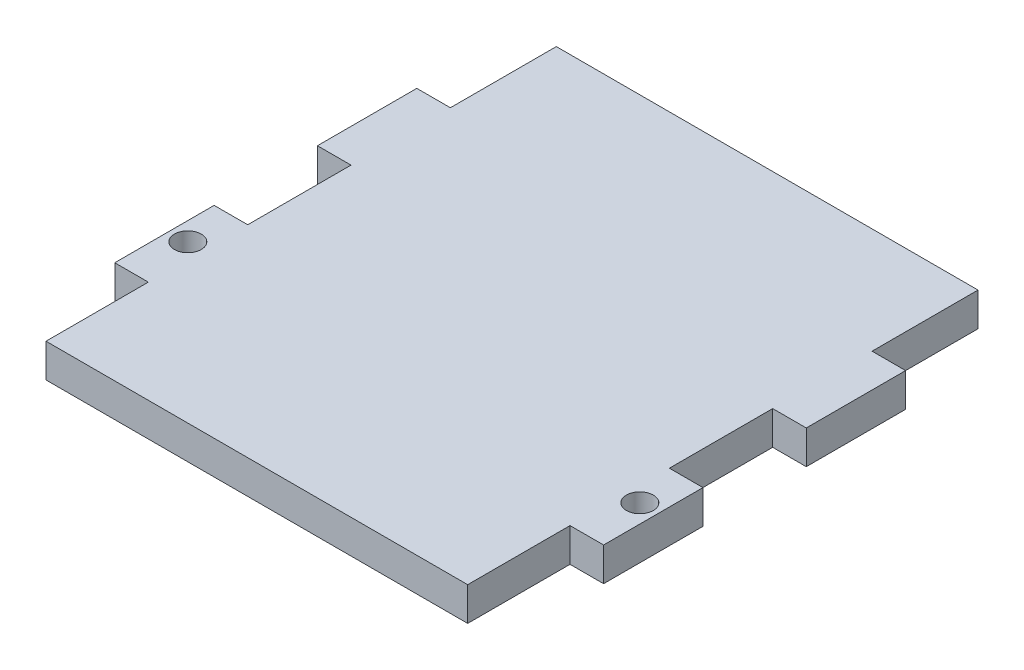
ISO-10303-21;
HEADER;
FILE_DESCRIPTION(('STEP AP214'),'2;1');
FILE_NAME('part.step','',(''),(''),'','','');
FILE_SCHEMA(('AUTOMOTIVE_DESIGN { 1 0 10303 214 1 1 1 1 }'));
ENDSEC;
DATA;
#1=APPLICATION_CONTEXT('core data for automotive mechanical design processes');
#2=APPLICATION_PROTOCOL_DEFINITION('international standard','automotive_design',2000,#1);
#3=PRODUCT_CONTEXT('',#1,'mechanical');
#4=PRODUCT('Part','Part','',(#3));
#5=PRODUCT_RELATED_PRODUCT_CATEGORY('part','',(#4));
#6=PRODUCT_DEFINITION_FORMATION('','',#4);
#7=PRODUCT_DEFINITION_CONTEXT('part definition',#1,'design');
#8=PRODUCT_DEFINITION('design','',#6,#7);
#9=PRODUCT_DEFINITION_SHAPE('','',#8);
#10=(LENGTH_UNIT() NAMED_UNIT(*) SI_UNIT(.MILLI.,.METRE.));
#11=(NAMED_UNIT(*) PLANE_ANGLE_UNIT() SI_UNIT($,.RADIAN.));
#12=(NAMED_UNIT(*) SI_UNIT($,.STERADIAN.) SOLID_ANGLE_UNIT());
#13=UNCERTAINTY_MEASURE_WITH_UNIT(LENGTH_MEASURE(1.E-05),#10,'distance_accuracy_value','');
#14=(GEOMETRIC_REPRESENTATION_CONTEXT(3) GLOBAL_UNCERTAINTY_ASSIGNED_CONTEXT((#13)) GLOBAL_UNIT_ASSIGNED_CONTEXT((#10,
#11,#12)) REPRESENTATION_CONTEXT('',''));
#15=CARTESIAN_POINT('',(0.,0.,0.));
#16=DIRECTION('',(0.,0.,1.));
#17=DIRECTION('',(1.,0.,0.));
#18=AXIS2_PLACEMENT_3D('',#15,#16,#17);
#19=CARTESIAN_POINT('',(-102.547126508136,6.35,-96.2364061321356));
#20=DIRECTION('',(0.,0.,1.));
#21=DIRECTION('',(1.,0.,0.));
#22=AXIS2_PLACEMENT_3D('',#19,#20,#21);
#23=PLANE('',#22);
#24=DIRECTION('',(-1.,0.,0.));
#25=VECTOR('',#24,1.);
#26=CARTESIAN_POINT('',(-102.547126508136,0.,-96.2364061321356));
#27=LINE('',#26,#25);
#28=CARTESIAN_POINT('',(39.6883770008071,0.,-96.2364061321356));
#29=VERTEX_POINT('',#28);
#30=CARTESIAN_POINT('',(-40.0676229991929,0.,-96.2364061321356));
#31=VERTEX_POINT('',#30);
#32=EDGE_CURVE('E210',#29,#31,#27,.T.);
#33=ORIENTED_EDGE('',*,*,#32,.T.);
#34=DIRECTION('',(0.,-1.,0.));
#35=VECTOR('',#34,1.);
#36=CARTESIAN_POINT('',(-40.0676229991929,6.35,-96.2364061321356));
#37=LINE('',#36,#35);
#38=CARTESIAN_POINT('',(-40.0676229991929,6.35,-96.2364061321356));
#39=VERTEX_POINT('',#38);
#40=EDGE_CURVE('E11',#39,#31,#37,.T.);
#41=ORIENTED_EDGE('',*,*,#40,.F.);
#42=DIRECTION('',(-1.,0.,0.));
#43=VECTOR('',#42,1.);
#44=CARTESIAN_POINT('',(-102.547126508136,6.35,-96.2364061321356));
#45=LINE('',#44,#43);
#46=CARTESIAN_POINT('',(39.6883770008071,6.35,-96.2364061321356));
#47=VERTEX_POINT('',#46);
#48=EDGE_CURVE('E268',#47,#39,#45,.T.);
#49=ORIENTED_EDGE('',*,*,#48,.F.);
#50=DIRECTION('',(0.,-1.,0.));
#51=VECTOR('',#50,1.);
#52=CARTESIAN_POINT('',(39.6883770008071,6.35,-96.2364061321356));
#53=LINE('',#52,#51);
#54=EDGE_CURVE('E49',#47,#29,#53,.T.);
#55=ORIENTED_EDGE('',*,*,#54,.T.);
#56=EDGE_LOOP('',(#33,#41,#49,#55));
#57=FACE_BOUND('',#56,.T.);
#58=ADVANCED_FACE('F33',(#57),#23,.F.);
#59=CARTESIAN_POINT('',(-40.0676229991929,6.35,-47.3190082823024));
#60=DIRECTION('',(1.,0.,0.));
#61=DIRECTION('',(0.,0.,-1.));
#62=AXIS2_PLACEMENT_3D('',#59,#60,#61);
#63=PLANE('',#62);
#64=DIRECTION('',(0.,0.,1.));
#65=VECTOR('',#64,1.);
#66=CARTESIAN_POINT('',(-40.0676229991929,0.,-47.3190082823024));
#67=LINE('',#66,#65);
#68=CARTESIAN_POINT('',(-40.0676229991929,0.,-76.1999950092736));
#69=VERTEX_POINT('',#68);
#70=EDGE_CURVE('E212',#31,#69,#67,.T.);
#71=ORIENTED_EDGE('',*,*,#70,.T.);
#72=DIRECTION('',(0.,-1.,0.));
#73=VECTOR('',#72,1.);
#74=CARTESIAN_POINT('',(-40.0676229991929,6.35,-76.1999950092736));
#75=LINE('',#74,#73);
#76=CARTESIAN_POINT('',(-40.0676229991929,6.35,-76.1999950092736));
#77=VERTEX_POINT('',#76);
#78=EDGE_CURVE('E41',#77,#69,#75,.T.);
#79=ORIENTED_EDGE('',*,*,#78,.F.);
#80=DIRECTION('',(0.,0.,1.));
#81=VECTOR('',#80,1.);
#82=CARTESIAN_POINT('',(-40.0676229991929,6.35,-47.3190082823024));
#83=LINE('',#82,#81);
#84=EDGE_CURVE('E124',#39,#77,#83,.T.);
#85=ORIENTED_EDGE('',*,*,#84,.F.);
#86=ORIENTED_EDGE('',*,*,#40,.T.);
#87=EDGE_LOOP('',(#71,#79,#85,#86));
#88=FACE_BOUND('',#87,.T.);
#89=ADVANCED_FACE('F308',(#88),#63,.F.);
#90=CARTESIAN_POINT('',(-102.547126508136,6.35,-76.1999950092736));
#91=DIRECTION('',(0.,0.,-1.));
#92=DIRECTION('',(-1.,0.,0.));
#93=AXIS2_PLACEMENT_3D('',#90,#91,#92);
#94=PLANE('',#93);
#95=DIRECTION('',(1.,0.,0.));
#96=VECTOR('',#95,1.);
#97=CARTESIAN_POINT('',(-102.547126508136,0.,-76.1999950092736));
#98=LINE('',#97,#96);
#99=CARTESIAN_POINT('',(-46.4176229991929,0.,-76.1999950092736));
#100=VERTEX_POINT('',#99);
#101=EDGE_CURVE('E215',#100,#69,#98,.T.);
#102=ORIENTED_EDGE('',*,*,#101,.F.);
#103=DIRECTION('',(0.,-1.,0.));
#104=VECTOR('',#103,1.);
#105=CARTESIAN_POINT('',(-46.4176229991929,6.35,-76.1999950092736));
#106=LINE('',#105,#104);
#107=CARTESIAN_POINT('',(-46.4176229991929,6.35,-76.1999950092736));
#108=VERTEX_POINT('',#107);
#109=EDGE_CURVE('E301',#108,#100,#106,.T.);
#110=ORIENTED_EDGE('',*,*,#109,.F.);
#111=DIRECTION('',(1.,0.,0.));
#112=VECTOR('',#111,1.);
#113=CARTESIAN_POINT('',(-102.547126508136,6.35,-76.1999950092736));
#114=LINE('',#113,#112);
#115=EDGE_CURVE('E307',#108,#77,#114,.T.);
#116=ORIENTED_EDGE('',*,*,#115,.T.);
#117=ORIENTED_EDGE('',*,*,#78,.T.);
#118=EDGE_LOOP('',(#102,#110,#116,#117));
#119=FACE_BOUND('',#118,.T.);
#120=ADVANCED_FACE('F305',(#119),#94,.T.);
#121=CARTESIAN_POINT('',(-46.4176229991928,6.35,-47.3190082823026));
#122=DIRECTION('',(-1.,0.,0.));
#123=DIRECTION('',(0.,0.,1.));
#124=AXIS2_PLACEMENT_3D('',#121,#122,#123);
#125=PLANE('',#124);
#126=DIRECTION('',(0.,0.,-1.));
#127=VECTOR('',#126,1.);
#128=CARTESIAN_POINT('',(-46.4176229991928,0.,-47.3190082823026));
#129=LINE('',#128,#127);
#130=CARTESIAN_POINT('',(-46.4176229991929,0.,-57.4039950092735));
#131=VERTEX_POINT('',#130);
#132=EDGE_CURVE('E218',#131,#100,#129,.T.);
#133=ORIENTED_EDGE('',*,*,#132,.F.);
#134=DIRECTION('',(0.,-1.,0.));
#135=VECTOR('',#134,1.);
#136=CARTESIAN_POINT('',(-46.4176229991929,6.35,-57.4039950092735));
#137=LINE('',#136,#135);
#138=CARTESIAN_POINT('',(-46.4176229991929,6.35,-57.4039950092735));
#139=VERTEX_POINT('',#138);
#140=EDGE_CURVE('E299',#139,#131,#137,.T.);
#141=ORIENTED_EDGE('',*,*,#140,.F.);
#142=DIRECTION('',(0.,0.,-1.));
#143=VECTOR('',#142,1.);
#144=CARTESIAN_POINT('',(-46.4176229991928,6.35,-47.3190082823026));
#145=LINE('',#144,#143);
#146=EDGE_CURVE('E320',#139,#108,#145,.T.);
#147=ORIENTED_EDGE('',*,*,#146,.T.);
#148=ORIENTED_EDGE('',*,*,#109,.T.);
#149=EDGE_LOOP('',(#133,#141,#147,#148));
#150=FACE_BOUND('',#149,.T.);
#151=ADVANCED_FACE('F317',(#150),#125,.T.);
#152=CARTESIAN_POINT('',(-102.547126508136,6.35,-57.4039950092731));
#153=DIRECTION('',(0.,0.,1.));
#154=DIRECTION('',(1.,0.,0.));
#155=AXIS2_PLACEMENT_3D('',#152,#153,#154);
#156=PLANE('',#155);
#157=DIRECTION('',(-1.,0.,0.));
#158=VECTOR('',#157,1.);
#159=CARTESIAN_POINT('',(-102.547126508136,0.,-57.4039950092731));
#160=LINE('',#159,#158);
#161=CARTESIAN_POINT('',(-40.0676229991929,0.,-57.4039950092735));
#162=VERTEX_POINT('',#161);
#163=EDGE_CURVE('E221',#162,#131,#160,.T.);
#164=ORIENTED_EDGE('',*,*,#163,.F.);
#165=DIRECTION('',(0.,-1.,0.));
#166=VECTOR('',#165,1.);
#167=CARTESIAN_POINT('',(-40.0676229991929,6.35,-57.4039950092735));
#168=LINE('',#167,#166);
#169=CARTESIAN_POINT('',(-40.0676229991929,6.35,-57.4039950092735));
#170=VERTEX_POINT('',#169);
#171=EDGE_CURVE('E297',#170,#162,#168,.T.);
#172=ORIENTED_EDGE('',*,*,#171,.F.);
#173=DIRECTION('',(-1.,0.,0.));
#174=VECTOR('',#173,1.);
#175=CARTESIAN_POINT('',(-102.547126508136,6.35,-57.4039950092731));
#176=LINE('',#175,#174);
#177=EDGE_CURVE('E324',#170,#139,#176,.T.);
#178=ORIENTED_EDGE('',*,*,#177,.T.);
#179=ORIENTED_EDGE('',*,*,#140,.T.);
#180=EDGE_LOOP('',(#164,#172,#178,#179));
#181=FACE_BOUND('',#180,.T.);
#182=ADVANCED_FACE('F536',(#181),#156,.T.);
#183=CARTESIAN_POINT('',(-40.0676229991929,6.35,-47.3190082823027));
#184=DIRECTION('',(1.,0.,0.));
#185=DIRECTION('',(0.,0.,-1.));
#186=AXIS2_PLACEMENT_3D('',#183,#184,#185);
#187=PLANE('',#186);
#188=DIRECTION('',(0.,0.,1.));
#189=VECTOR('',#188,1.);
#190=CARTESIAN_POINT('',(-40.0676229991929,0.,-47.3190082823027));
#191=LINE('',#190,#189);
#192=CARTESIAN_POINT('',(-40.0676229991928,0.,-37.8672061321356));
#193=VERTEX_POINT('',#192);
#194=EDGE_CURVE('E224',#162,#193,#191,.T.);
#195=ORIENTED_EDGE('',*,*,#194,.T.);
#196=DIRECTION('',(0.,-1.,0.));
#197=VECTOR('',#196,1.);
#198=CARTESIAN_POINT('',(-40.0676229991928,6.35,-37.8672061321356));
#199=LINE('',#198,#197);
#200=CARTESIAN_POINT('',(-40.0676229991928,6.35,-37.8672061321356));
#201=VERTEX_POINT('',#200);
#202=EDGE_CURVE('E294',#201,#193,#199,.T.);
#203=ORIENTED_EDGE('',*,*,#202,.F.);
#204=DIRECTION('',(0.,0.,1.));
#205=VECTOR('',#204,1.);
#206=CARTESIAN_POINT('',(-40.0676229991929,6.35,-47.3190082823027));
#207=LINE('',#206,#205);
#208=EDGE_CURVE('E330',#170,#201,#207,.T.);
#209=ORIENTED_EDGE('',*,*,#208,.F.);
#210=ORIENTED_EDGE('',*,*,#171,.T.);
#211=EDGE_LOOP('',(#195,#203,#209,#210));
#212=FACE_BOUND('',#211,.T.);
#213=ADVANCED_FACE('F527',(#212),#187,.F.);
#214=CARTESIAN_POINT('',(-102.547126508136,6.35,-37.8672061321356));
#215=DIRECTION('',(0.,0.,1.));
#216=DIRECTION('',(1.,0.,0.));
#217=AXIS2_PLACEMENT_3D('',#214,#215,#216);
#218=PLANE('',#217);
#219=DIRECTION('',(-1.,0.,0.));
#220=VECTOR('',#219,1.);
#221=CARTESIAN_POINT('',(-102.547126508136,0.,-37.8672061321356));
#222=LINE('',#221,#220);
#223=CARTESIAN_POINT('',(-46.4176229991928,0.,-37.8672061321356));
#224=VERTEX_POINT('',#223);
#225=EDGE_CURVE('E226',#193,#224,#222,.T.);
#226=ORIENTED_EDGE('',*,*,#225,.T.);
#227=DIRECTION('',(0.,-1.,0.));
#228=VECTOR('',#227,1.);
#229=CARTESIAN_POINT('',(-46.4176229991928,6.35,-37.8672061321356));
#230=LINE('',#229,#228);
#231=CARTESIAN_POINT('',(-46.4176229991928,6.35,-37.8672061321356));
#232=VERTEX_POINT('',#231);
#233=EDGE_CURVE('E292',#232,#224,#230,.T.);
#234=ORIENTED_EDGE('',*,*,#233,.F.);
#235=DIRECTION('',(-1.,0.,0.));
#236=VECTOR('',#235,1.);
#237=CARTESIAN_POINT('',(-102.547126508136,6.35,-37.8672061321356));
#238=LINE('',#237,#236);
#239=EDGE_CURVE('E332',#201,#232,#238,.T.);
#240=ORIENTED_EDGE('',*,*,#239,.F.);
#241=ORIENTED_EDGE('',*,*,#202,.T.);
#242=EDGE_LOOP('',(#226,#234,#240,#241));
#243=FACE_BOUND('',#242,.T.);
#244=ADVANCED_FACE('F518',(#243),#218,.F.);
#245=CARTESIAN_POINT('',(-46.4176229991928,6.35,-47.3190082823023));
#246=DIRECTION('',(-1.,0.,0.));
#247=DIRECTION('',(0.,0.,1.));
#248=AXIS2_PLACEMENT_3D('',#245,#246,#247);
#249=PLANE('',#248);
#250=DIRECTION('',(0.,0.,-1.));
#251=VECTOR('',#250,1.);
#252=CARTESIAN_POINT('',(-46.4176229991928,0.,-47.3190082823023));
#253=LINE('',#252,#251);
#254=CARTESIAN_POINT('',(-46.4176229991929,0.,-19.0712061321356));
#255=VERTEX_POINT('',#254);
#256=EDGE_CURVE('E229',#255,#224,#253,.T.);
#257=ORIENTED_EDGE('',*,*,#256,.F.);
#258=DIRECTION('',(0.,-1.,0.));
#259=VECTOR('',#258,1.);
#260=CARTESIAN_POINT('',(-46.4176229991929,6.35,-19.0712061321356));
#261=LINE('',#260,#259);
#262=CARTESIAN_POINT('',(-46.4176229991929,6.35,-19.0712061321356));
#263=VERTEX_POINT('',#262);
#264=EDGE_CURVE('E290',#263,#255,#261,.T.);
#265=ORIENTED_EDGE('',*,*,#264,.F.);
#266=DIRECTION('',(0.,0.,-1.));
#267=VECTOR('',#266,1.);
#268=CARTESIAN_POINT('',(-46.4176229991928,6.35,-47.3190082823023));
#269=LINE('',#268,#267);
#270=EDGE_CURVE('E334',#263,#232,#269,.T.);
#271=ORIENTED_EDGE('',*,*,#270,.T.);
#272=ORIENTED_EDGE('',*,*,#233,.T.);
#273=EDGE_LOOP('',(#257,#265,#271,#272));
#274=FACE_BOUND('',#273,.T.);
#275=ADVANCED_FACE('F509',(#274),#249,.T.);
#276=CARTESIAN_POINT('',(-102.547126508136,6.35,-19.0712061321356));
#277=DIRECTION('',(0.,0.,-1.));
#278=DIRECTION('',(-1.,0.,0.));
#279=AXIS2_PLACEMENT_3D('',#276,#277,#278);
#280=PLANE('',#279);
#281=DIRECTION('',(1.,0.,0.));
#282=VECTOR('',#281,1.);
#283=CARTESIAN_POINT('',(-102.547126508136,0.,-19.0712061321356));
#284=LINE('',#283,#282);
#285=CARTESIAN_POINT('',(-40.0676229991928,0.,-19.0712061321356));
#286=VERTEX_POINT('',#285);
#287=EDGE_CURVE('E232',#255,#286,#284,.T.);
#288=ORIENTED_EDGE('',*,*,#287,.T.);
#289=DIRECTION('',(0.,-1.,0.));
#290=VECTOR('',#289,1.);
#291=CARTESIAN_POINT('',(-40.0676229991928,6.35,-19.0712061321356));
#292=LINE('',#291,#290);
#293=CARTESIAN_POINT('',(-40.0676229991928,6.35,-19.0712061321356));
#294=VERTEX_POINT('',#293);
#295=EDGE_CURVE('E287',#294,#286,#292,.T.);
#296=ORIENTED_EDGE('',*,*,#295,.F.);
#297=DIRECTION('',(1.,0.,0.));
#298=VECTOR('',#297,1.);
#299=CARTESIAN_POINT('',(-102.547126508136,6.35,-19.0712061321356));
#300=LINE('',#299,#298);
#301=EDGE_CURVE('E337',#263,#294,#300,.T.);
#302=ORIENTED_EDGE('',*,*,#301,.F.);
#303=ORIENTED_EDGE('',*,*,#264,.T.);
#304=EDGE_LOOP('',(#288,#296,#302,#303));
#305=FACE_BOUND('',#304,.T.);
#306=ADVANCED_FACE('F500',(#305),#280,.F.);
#307=CARTESIAN_POINT('',(-40.0676229991928,6.35,-47.3190082823025));
#308=DIRECTION('',(1.,0.,0.));
#309=DIRECTION('',(0.,0.,-1.));
#310=AXIS2_PLACEMENT_3D('',#307,#308,#309);
#311=PLANE('',#310);
#312=DIRECTION('',(0.,0.,1.));
#313=VECTOR('',#312,1.);
#314=CARTESIAN_POINT('',(-40.0676229991928,0.,-47.3190082823025));
#315=LINE('',#314,#313);
#316=CARTESIAN_POINT('',(-40.0676229991928,0.,0.283593867864403));
#317=VERTEX_POINT('',#316);
#318=EDGE_CURVE('E234',#286,#317,#315,.T.);
#319=ORIENTED_EDGE('',*,*,#318,.T.);
#320=DIRECTION('',(0.,-1.,0.));
#321=VECTOR('',#320,1.);
#322=CARTESIAN_POINT('',(-40.0676229991928,6.35,0.283593867864403));
#323=LINE('',#322,#321);
#324=CARTESIAN_POINT('',(-40.0676229991928,6.35,0.283593867864403));
#325=VERTEX_POINT('',#324);
#326=EDGE_CURVE('E284',#325,#317,#323,.T.);
#327=ORIENTED_EDGE('',*,*,#326,.F.);
#328=DIRECTION('',(0.,0.,1.));
#329=VECTOR('',#328,1.);
#330=CARTESIAN_POINT('',(-40.0676229991928,6.35,-47.3190082823025));
#331=LINE('',#330,#329);
#332=EDGE_CURVE('E339',#294,#325,#331,.T.);
#333=ORIENTED_EDGE('',*,*,#332,.F.);
#334=ORIENTED_EDGE('',*,*,#295,.T.);
#335=EDGE_LOOP('',(#319,#327,#333,#334));
#336=FACE_BOUND('',#335,.T.);
#337=ADVANCED_FACE('F491',(#336),#311,.F.);
#338=CARTESIAN_POINT('',(-102.547126508136,6.35,0.283593867864411));
#339=DIRECTION('',(0.,0.,-1.));
#340=DIRECTION('',(-1.,0.,0.));
#341=AXIS2_PLACEMENT_3D('',#338,#339,#340);
#342=PLANE('',#341);
#343=DIRECTION('',(1.,0.,0.));
#344=VECTOR('',#343,1.);
#345=CARTESIAN_POINT('',(-102.547126508136,0.,0.283593867864411));
#346=LINE('',#345,#344);
#347=CARTESIAN_POINT('',(39.688377000807,0.,0.283593867864394));
#348=VERTEX_POINT('',#347);
#349=EDGE_CURVE('E236',#317,#348,#346,.T.);
#350=ORIENTED_EDGE('',*,*,#349,.T.);
#351=DIRECTION('',(0.,-1.,0.));
#352=VECTOR('',#351,1.);
#353=CARTESIAN_POINT('',(39.688377000807,6.35,0.283593867864394));
#354=LINE('',#353,#352);
#355=CARTESIAN_POINT('',(39.688377000807,6.35,0.283593867864394));
#356=VERTEX_POINT('',#355);
#357=EDGE_CURVE('E282',#356,#348,#354,.T.);
#358=ORIENTED_EDGE('',*,*,#357,.F.);
#359=DIRECTION('',(1.,0.,0.));
#360=VECTOR('',#359,1.);
#361=CARTESIAN_POINT('',(-102.547126508136,6.35,0.283593867864411));
#362=LINE('',#361,#360);
#363=EDGE_CURVE('E341',#325,#356,#362,.T.);
#364=ORIENTED_EDGE('',*,*,#363,.F.);
#365=ORIENTED_EDGE('',*,*,#326,.T.);
#366=EDGE_LOOP('',(#350,#358,#364,#365));
#367=FACE_BOUND('',#366,.T.);
#368=ADVANCED_FACE('F482',(#367),#342,.F.);
#369=CARTESIAN_POINT('',(39.688377000807,6.35,-47.3190082823023));
#370=DIRECTION('',(1.,0.,0.));
#371=DIRECTION('',(0.,0.,-1.));
#372=AXIS2_PLACEMENT_3D('',#369,#370,#371);
#373=PLANE('',#372);
#374=DIRECTION('',(0.,0.,1.));
#375=VECTOR('',#374,1.);
#376=CARTESIAN_POINT('',(39.688377000807,0.,-47.3190082823023));
#377=LINE('',#376,#375);
#378=CARTESIAN_POINT('',(39.688377000807,0.,-19.0712061321356));
#379=VERTEX_POINT('',#378);
#380=EDGE_CURVE('E239',#379,#348,#377,.T.);
#381=ORIENTED_EDGE('',*,*,#380,.F.);
#382=DIRECTION('',(0.,-1.,0.));
#383=VECTOR('',#382,1.);
#384=CARTESIAN_POINT('',(39.688377000807,6.35,-19.0712061321356));
#385=LINE('',#384,#383);
#386=CARTESIAN_POINT('',(39.688377000807,6.35,-19.0712061321356));
#387=VERTEX_POINT('',#386);
#388=EDGE_CURVE('E280',#387,#379,#385,.T.);
#389=ORIENTED_EDGE('',*,*,#388,.F.);
#390=DIRECTION('',(0.,0.,1.));
#391=VECTOR('',#390,1.);
#392=CARTESIAN_POINT('',(39.688377000807,6.35,-47.3190082823023));
#393=LINE('',#392,#391);
#394=EDGE_CURVE('E343',#387,#356,#393,.T.);
#395=ORIENTED_EDGE('',*,*,#394,.T.);
#396=ORIENTED_EDGE('',*,*,#357,.T.);
#397=EDGE_LOOP('',(#381,#389,#395,#396));
#398=FACE_BOUND('',#397,.T.);
#399=ADVANCED_FACE('F473',(#398),#373,.T.);
#400=CARTESIAN_POINT('',(-102.547126508136,6.35,-19.0712061321356));
#401=DIRECTION('',(0.,0.,1.));
#402=DIRECTION('',(1.,0.,0.));
#403=AXIS2_PLACEMENT_3D('',#400,#401,#402);
#404=PLANE('',#403);
#405=DIRECTION('',(-1.,0.,0.));
#406=VECTOR('',#405,1.);
#407=CARTESIAN_POINT('',(-102.547126508136,0.,-19.0712061321356));
#408=LINE('',#407,#406);
#409=CARTESIAN_POINT('',(46.038377000807,0.,-19.0712061321356));
#410=VERTEX_POINT('',#409);
#411=EDGE_CURVE('E242',#410,#379,#408,.T.);
#412=ORIENTED_EDGE('',*,*,#411,.F.);
#413=DIRECTION('',(0.,-1.,0.));
#414=VECTOR('',#413,1.);
#415=CARTESIAN_POINT('',(46.038377000807,6.35,-19.0712061321356));
#416=LINE('',#415,#414);
#417=CARTESIAN_POINT('',(46.038377000807,6.35,-19.0712061321356));
#418=VERTEX_POINT('',#417);
#419=EDGE_CURVE('E278',#418,#410,#416,.T.);
#420=ORIENTED_EDGE('',*,*,#419,.F.);
#421=DIRECTION('',(-1.,0.,0.));
#422=VECTOR('',#421,1.);
#423=CARTESIAN_POINT('',(-102.547126508136,6.35,-19.0712061321356));
#424=LINE('',#423,#422);
#425=EDGE_CURVE('E346',#418,#387,#424,.T.);
#426=ORIENTED_EDGE('',*,*,#425,.T.);
#427=ORIENTED_EDGE('',*,*,#388,.T.);
#428=EDGE_LOOP('',(#412,#420,#426,#427));
#429=FACE_BOUND('',#428,.T.);
#430=ADVANCED_FACE('F464',(#429),#404,.T.);
#431=CARTESIAN_POINT('',(46.038377000807,6.35,-47.3190082823026));
#432=DIRECTION('',(-1.,0.,0.));
#433=DIRECTION('',(0.,0.,1.));
#434=AXIS2_PLACEMENT_3D('',#431,#432,#433);
#435=PLANE('',#434);
#436=DIRECTION('',(0.,0.,-1.));
#437=VECTOR('',#436,1.);
#438=CARTESIAN_POINT('',(46.038377000807,0.,-47.3190082823026));
#439=LINE('',#438,#437);
#440=CARTESIAN_POINT('',(46.038377000807,0.,-37.8672061321356));
#441=VERTEX_POINT('',#440);
#442=EDGE_CURVE('E245',#410,#441,#439,.T.);
#443=ORIENTED_EDGE('',*,*,#442,.T.);
#444=DIRECTION('',(0.,-1.,0.));
#445=VECTOR('',#444,1.);
#446=CARTESIAN_POINT('',(46.038377000807,6.35,-37.8672061321356));
#447=LINE('',#446,#445);
#448=CARTESIAN_POINT('',(46.038377000807,6.35,-37.8672061321356));
#449=VERTEX_POINT('',#448);
#450=EDGE_CURVE('E276',#449,#441,#447,.T.);
#451=ORIENTED_EDGE('',*,*,#450,.F.);
#452=DIRECTION('',(0.,0.,-1.));
#453=VECTOR('',#452,1.);
#454=CARTESIAN_POINT('',(46.038377000807,6.35,-47.3190082823026));
#455=LINE('',#454,#453);
#456=EDGE_CURVE('E349',#418,#449,#455,.T.);
#457=ORIENTED_EDGE('',*,*,#456,.F.);
#458=ORIENTED_EDGE('',*,*,#419,.T.);
#459=EDGE_LOOP('',(#443,#451,#457,#458));
#460=FACE_BOUND('',#459,.T.);
#461=ADVANCED_FACE('F456',(#460),#435,.F.);
#462=CARTESIAN_POINT('',(-102.547126508136,6.35,-37.8672061321354));
#463=DIRECTION('',(0.,0.,-1.));
#464=DIRECTION('',(-1.,0.,0.));
#465=AXIS2_PLACEMENT_3D('',#462,#463,#464);
#466=PLANE('',#465);
#467=DIRECTION('',(1.,0.,0.));
#468=VECTOR('',#467,1.);
#469=CARTESIAN_POINT('',(-102.547126508136,0.,-37.8672061321354));
#470=LINE('',#469,#468);
#471=CARTESIAN_POINT('',(39.688377000807,0.,-37.8672061321356));
#472=VERTEX_POINT('',#471);
#473=EDGE_CURVE('E248',#472,#441,#470,.T.);
#474=ORIENTED_EDGE('',*,*,#473,.F.);
#475=DIRECTION('',(0.,-1.,0.));
#476=VECTOR('',#475,1.);
#477=CARTESIAN_POINT('',(39.688377000807,6.35,-37.8672061321356));
#478=LINE('',#477,#476);
#479=CARTESIAN_POINT('',(39.688377000807,6.35,-37.8672061321356));
#480=VERTEX_POINT('',#479);
#481=EDGE_CURVE('E274',#480,#472,#478,.T.);
#482=ORIENTED_EDGE('',*,*,#481,.F.);
#483=DIRECTION('',(1.,0.,0.));
#484=VECTOR('',#483,1.);
#485=CARTESIAN_POINT('',(-102.547126508136,6.35,-37.8672061321354));
#486=LINE('',#485,#484);
#487=EDGE_CURVE('E351',#480,#449,#486,.T.);
#488=ORIENTED_EDGE('',*,*,#487,.T.);
#489=ORIENTED_EDGE('',*,*,#450,.T.);
#490=EDGE_LOOP('',(#474,#482,#488,#489));
#491=FACE_BOUND('',#490,.T.);
#492=ADVANCED_FACE('F365',(#491),#466,.T.);
#493=CARTESIAN_POINT('',(39.6883770008071,6.35,-47.3190082823018));
#494=DIRECTION('',(1.,0.,0.));
#495=DIRECTION('',(0.,0.,-1.));
#496=AXIS2_PLACEMENT_3D('',#493,#494,#495);
#497=PLANE('',#496);
#498=DIRECTION('',(0.,0.,1.));
#499=VECTOR('',#498,1.);
#500=CARTESIAN_POINT('',(39.6883770008071,0.,-47.3190082823018));
#501=LINE('',#500,#499);
#502=CARTESIAN_POINT('',(39.6883770008071,0.,-57.4039950092735));
#503=VERTEX_POINT('',#502);
#504=EDGE_CURVE('E251',#503,#472,#501,.T.);
#505=ORIENTED_EDGE('',*,*,#504,.F.);
#506=DIRECTION('',(0.,-1.,0.));
#507=VECTOR('',#506,1.);
#508=CARTESIAN_POINT('',(39.6883770008071,6.35,-57.4039950092735));
#509=LINE('',#508,#507);
#510=CARTESIAN_POINT('',(39.6883770008071,6.35,-57.4039950092735));
#511=VERTEX_POINT('',#510);
#512=EDGE_CURVE('E272',#511,#503,#509,.T.);
#513=ORIENTED_EDGE('',*,*,#512,.F.);
#514=DIRECTION('',(0.,0.,1.));
#515=VECTOR('',#514,1.);
#516=CARTESIAN_POINT('',(39.6883770008071,6.35,-47.3190082823018));
#517=LINE('',#516,#515);
#518=EDGE_CURVE('E354',#511,#480,#517,.T.);
#519=ORIENTED_EDGE('',*,*,#518,.T.);
#520=ORIENTED_EDGE('',*,*,#481,.T.);
#521=EDGE_LOOP('',(#505,#513,#519,#520));
#522=FACE_BOUND('',#521,.T.);
#523=ADVANCED_FACE('F358',(#522),#497,.T.);
#524=CARTESIAN_POINT('',(-102.547126508136,6.35,-57.4039950092735));
#525=DIRECTION('',(0.,0.,-1.));
#526=DIRECTION('',(-1.,0.,0.));
#527=AXIS2_PLACEMENT_3D('',#524,#525,#526);
#528=PLANE('',#527);
#529=DIRECTION('',(1.,0.,0.));
#530=VECTOR('',#529,1.);
#531=CARTESIAN_POINT('',(-102.547126508136,0.,-57.4039950092735));
#532=LINE('',#531,#530);
#533=CARTESIAN_POINT('',(46.0383770008071,0.,-57.4039950092735));
#534=VERTEX_POINT('',#533);
#535=EDGE_CURVE('E254',#503,#534,#532,.T.);
#536=ORIENTED_EDGE('',*,*,#535,.T.);
#537=DIRECTION('',(0.,-1.,0.));
#538=VECTOR('',#537,1.);
#539=CARTESIAN_POINT('',(46.0383770008071,6.35,-57.4039950092735));
#540=LINE('',#539,#538);
#541=CARTESIAN_POINT('',(46.0383770008071,6.35,-57.4039950092735));
#542=VERTEX_POINT('',#541);
#543=EDGE_CURVE('E196',#542,#534,#540,.T.);
#544=ORIENTED_EDGE('',*,*,#543,.F.);
#545=DIRECTION('',(1.,0.,0.));
#546=VECTOR('',#545,1.);
#547=CARTESIAN_POINT('',(-102.547126508136,6.35,-57.4039950092735));
#548=LINE('',#547,#546);
#549=EDGE_CURVE('E184',#511,#542,#548,.T.);
#550=ORIENTED_EDGE('',*,*,#549,.F.);
#551=ORIENTED_EDGE('',*,*,#512,.T.);
#552=EDGE_LOOP('',(#536,#544,#550,#551));
#553=FACE_BOUND('',#552,.T.);
#554=ADVANCED_FACE('F369',(#553),#528,.F.);
#555=CARTESIAN_POINT('',(46.0383770008071,6.35,-47.3190082823023));
#556=DIRECTION('',(-1.,0.,0.));
#557=DIRECTION('',(0.,0.,1.));
#558=AXIS2_PLACEMENT_3D('',#555,#556,#557);
#559=PLANE('',#558);
#560=DIRECTION('',(0.,0.,-1.));
#561=VECTOR('',#560,1.);
#562=CARTESIAN_POINT('',(46.0383770008071,0.,-47.3190082823023));
#563=LINE('',#562,#561);
#564=CARTESIAN_POINT('',(46.0383770008071,0.,-76.1999950092736));
#565=VERTEX_POINT('',#564);
#566=EDGE_CURVE('E193',#534,#565,#563,.T.);
#567=ORIENTED_EDGE('',*,*,#566,.T.);
#568=DIRECTION('',(0.,-1.,0.));
#569=VECTOR('',#568,1.);
#570=CARTESIAN_POINT('',(46.0383770008071,6.35,-76.1999950092736));
#571=LINE('',#570,#569);
#572=CARTESIAN_POINT('',(46.0383770008071,6.35,-76.1999950092736));
#573=VERTEX_POINT('',#572);
#574=EDGE_CURVE('E190',#573,#565,#571,.T.);
#575=ORIENTED_EDGE('',*,*,#574,.F.);
#576=DIRECTION('',(0.,0.,-1.));
#577=VECTOR('',#576,1.);
#578=CARTESIAN_POINT('',(46.0383770008071,6.35,-47.3190082823023));
#579=LINE('',#578,#577);
#580=EDGE_CURVE('E175',#542,#573,#579,.T.);
#581=ORIENTED_EDGE('',*,*,#580,.F.);
#582=ORIENTED_EDGE('',*,*,#543,.T.);
#583=EDGE_LOOP('',(#567,#575,#581,#582));
#584=FACE_BOUND('',#583,.T.);
#585=ADVANCED_FACE('F191',(#584),#559,.F.);
#586=CARTESIAN_POINT('',(-102.547126508136,6.35,-76.1999950092736));
#587=DIRECTION('',(0.,0.,1.));
#588=DIRECTION('',(1.,0.,0.));
#589=AXIS2_PLACEMENT_3D('',#586,#587,#588);
#590=PLANE('',#589);
#591=DIRECTION('',(-1.,0.,0.));
#592=VECTOR('',#591,1.);
#593=CARTESIAN_POINT('',(-102.547126508136,0.,-76.1999950092736));
#594=LINE('',#593,#592);
#595=CARTESIAN_POINT('',(39.6883770008071,0.,-76.1999950092736));
#596=VERTEX_POINT('',#595);
#597=EDGE_CURVE('E257',#565,#596,#594,.T.);
#598=ORIENTED_EDGE('',*,*,#597,.T.);
#599=DIRECTION('',(0.,-1.,0.));
#600=VECTOR('',#599,1.);
#601=CARTESIAN_POINT('',(39.6883770008071,6.35,-76.1999950092736));
#602=LINE('',#601,#600);
#603=CARTESIAN_POINT('',(39.6883770008071,6.35,-76.1999950092736));
#604=VERTEX_POINT('',#603);
#605=EDGE_CURVE('E112',#604,#596,#602,.T.);
#606=ORIENTED_EDGE('',*,*,#605,.F.);
#607=DIRECTION('',(-1.,0.,0.));
#608=VECTOR('',#607,1.);
#609=CARTESIAN_POINT('',(-102.547126508136,6.35,-76.1999950092736));
#610=LINE('',#609,#608);
#611=EDGE_CURVE('E181',#573,#604,#610,.T.);
#612=ORIENTED_EDGE('',*,*,#611,.F.);
#613=ORIENTED_EDGE('',*,*,#574,.T.);
#614=EDGE_LOOP('',(#598,#606,#612,#613));
#615=FACE_BOUND('',#614,.T.);
#616=ADVANCED_FACE('F198',(#615),#590,.F.);
#617=CARTESIAN_POINT('',(42.5592848215392,6.35,-29.4105659981681));
#618=DIRECTION('',(0.,-1.,0.));
#619=DIRECTION('',(0.,0.,-1.));
#620=AXIS2_PLACEMENT_3D('',#617,#618,#619);
#621=CYLINDRICAL_SURFACE('',#620,2.54);
#622=CARTESIAN_POINT('',(42.5592848215392,6.35,-29.4105659981681));
#623=DIRECTION('',(0.,1.,0.));
#624=DIRECTION('',(0.,0.,1.));
#625=AXIS2_PLACEMENT_3D('',#622,#623,#624);
#626=CIRCLE('',#625,2.54);
#627=CARTESIAN_POINT('',(42.5592848215392,6.35,-26.8705659981681));
#628=VERTEX_POINT('',#627);
#629=EDGE_CURVE('E201',#628,#628,#626,.T.);
#630=ORIENTED_EDGE('',*,*,#629,.T.);
#631=EDGE_LOOP('',(#630));
#632=FACE_BOUND('',#631,.T.);
#633=CARTESIAN_POINT('',(42.5592848215392,0.,-29.4105659981681));
#634=DIRECTION('',(0.,1.,0.));
#635=DIRECTION('',(0.,0.,1.));
#636=AXIS2_PLACEMENT_3D('',#633,#634,#635);
#637=CIRCLE('',#636,2.54);
#638=CARTESIAN_POINT('',(42.5592848215392,0.,-26.8705659981681));
#639=VERTEX_POINT('',#638);
#640=EDGE_CURVE('E262',#639,#639,#637,.T.);
#641=ORIENTED_EDGE('',*,*,#640,.F.);
#642=EDGE_LOOP('',(#641));
#643=FACE_BOUND('',#642,.T.);
#644=ADVANCED_FACE('F385',(#632,#643),#621,.F.);
#645=CARTESIAN_POINT('',(39.6883770008071,6.35,-47.3190082823023));
#646=DIRECTION('',(1.,0.,0.));
#647=DIRECTION('',(0.,0.,-1.));
#648=AXIS2_PLACEMENT_3D('',#645,#646,#647);
#649=PLANE('',#648);
#650=DIRECTION('',(0.,0.,1.));
#651=VECTOR('',#650,1.);
#652=CARTESIAN_POINT('',(39.6883770008071,0.,-47.3190082823023));
#653=LINE('',#652,#651);
#654=EDGE_CURVE('E259',#29,#596,#653,.T.);
#655=ORIENTED_EDGE('',*,*,#654,.F.);
#656=ORIENTED_EDGE('',*,*,#54,.F.);
#657=DIRECTION('',(0.,0.,1.));
#658=VECTOR('',#657,1.);
#659=CARTESIAN_POINT('',(39.6883770008071,6.35,-47.3190082823023));
#660=LINE('',#659,#658);
#661=EDGE_CURVE('E199',#47,#604,#660,.T.);
#662=ORIENTED_EDGE('',*,*,#661,.T.);
#663=ORIENTED_EDGE('',*,*,#605,.T.);
#664=EDGE_LOOP('',(#655,#656,#662,#663));
#665=FACE_BOUND('',#664,.T.);
#666=ADVANCED_FACE('F382',(#665),#649,.T.);
#667=CARTESIAN_POINT('',(-42.9385308199251,6.35,-29.4105659981681));
#668=DIRECTION('',(0.,-1.,0.));
#669=DIRECTION('',(0.,0.,-1.));
#670=AXIS2_PLACEMENT_3D('',#667,#668,#669);
#671=CYLINDRICAL_SURFACE('',#670,2.54);
#672=CARTESIAN_POINT('',(-42.9385308199251,6.35,-29.4105659981681));
#673=DIRECTION('',(0.,1.,0.));
#674=DIRECTION('',(0.,0.,1.));
#675=AXIS2_PLACEMENT_3D('',#672,#673,#674);
#676=CIRCLE('',#675,2.54);
#677=CARTESIAN_POINT('',(-42.9385308199251,6.35,-26.8705659981681));
#678=VERTEX_POINT('',#677);
#679=EDGE_CURVE('E207',#678,#678,#676,.F.);
#680=ORIENTED_EDGE('',*,*,#679,.F.);
#681=EDGE_LOOP('',(#680));
#682=FACE_BOUND('',#681,.T.);
#683=CARTESIAN_POINT('',(-42.9385308199251,0.,-29.4105659981681));
#684=DIRECTION('',(0.,1.,0.));
#685=DIRECTION('',(0.,0.,1.));
#686=AXIS2_PLACEMENT_3D('',#683,#684,#685);
#687=CIRCLE('',#686,2.54);
#688=CARTESIAN_POINT('',(-42.9385308199251,0.,-26.8705659981681));
#689=VERTEX_POINT('',#688);
#690=EDGE_CURVE('E265',#689,#689,#687,.F.);
#691=ORIENTED_EDGE('',*,*,#690,.T.);
#692=EDGE_LOOP('',(#691));
#693=FACE_BOUND('',#692,.T.);
#694=ADVANCED_FACE('F384',(#682,#693),#671,.F.);
#695=CARTESIAN_POINT('',(-102.547126508136,6.35,-47.3190082823024));
#696=DIRECTION('',(0.,1.,0.));
#697=DIRECTION('',(0.,0.,1.));
#698=AXIS2_PLACEMENT_3D('',#695,#696,#697);
#699=PLANE('',#698);
#700=ORIENTED_EDGE('',*,*,#48,.T.);
#701=ORIENTED_EDGE('',*,*,#84,.T.);
#702=ORIENTED_EDGE('',*,*,#115,.F.);
#703=ORIENTED_EDGE('',*,*,#146,.F.);
#704=ORIENTED_EDGE('',*,*,#177,.F.);
#705=ORIENTED_EDGE('',*,*,#208,.T.);
#706=ORIENTED_EDGE('',*,*,#239,.T.);
#707=ORIENTED_EDGE('',*,*,#270,.F.);
#708=ORIENTED_EDGE('',*,*,#301,.T.);
#709=ORIENTED_EDGE('',*,*,#332,.T.);
#710=ORIENTED_EDGE('',*,*,#363,.T.);
#711=ORIENTED_EDGE('',*,*,#394,.F.);
#712=ORIENTED_EDGE('',*,*,#425,.F.);
#713=ORIENTED_EDGE('',*,*,#456,.T.);
#714=ORIENTED_EDGE('',*,*,#487,.F.);
#715=ORIENTED_EDGE('',*,*,#518,.F.);
#716=ORIENTED_EDGE('',*,*,#549,.T.);
#717=ORIENTED_EDGE('',*,*,#580,.T.);
#718=ORIENTED_EDGE('',*,*,#611,.T.);
#719=ORIENTED_EDGE('',*,*,#661,.F.);
#720=EDGE_LOOP('',(#700,#701,#702,#703,#704,#705,#706,#707,#708,#709,#710,#711,#712,#713,#714,
#715,#716,#717,#718,#719));
#721=FACE_BOUND('',#720,.T.);
#722=ORIENTED_EDGE('',*,*,#629,.F.);
#723=EDGE_LOOP('',(#722));
#724=FACE_BOUND('',#723,.T.);
#725=ORIENTED_EDGE('',*,*,#679,.T.);
#726=EDGE_LOOP('',(#725));
#727=FACE_BOUND('',#726,.T.);
#728=ADVANCED_FACE('F177',(#721,#724,#727),#699,.T.);
#729=CARTESIAN_POINT('',(-102.547126508136,0.,-47.3190082823024));
#730=DIRECTION('',(0.,1.,0.));
#731=DIRECTION('',(0.,0.,1.));
#732=AXIS2_PLACEMENT_3D('',#729,#730,#731);
#733=PLANE('',#732);
#734=ORIENTED_EDGE('',*,*,#32,.F.);
#735=ORIENTED_EDGE('',*,*,#654,.T.);
#736=ORIENTED_EDGE('',*,*,#597,.F.);
#737=ORIENTED_EDGE('',*,*,#566,.F.);
#738=ORIENTED_EDGE('',*,*,#535,.F.);
#739=ORIENTED_EDGE('',*,*,#504,.T.);
#740=ORIENTED_EDGE('',*,*,#473,.T.);
#741=ORIENTED_EDGE('',*,*,#442,.F.);
#742=ORIENTED_EDGE('',*,*,#411,.T.);
#743=ORIENTED_EDGE('',*,*,#380,.T.);
#744=ORIENTED_EDGE('',*,*,#349,.F.);
#745=ORIENTED_EDGE('',*,*,#318,.F.);
#746=ORIENTED_EDGE('',*,*,#287,.F.);
#747=ORIENTED_EDGE('',*,*,#256,.T.);
#748=ORIENTED_EDGE('',*,*,#225,.F.);
#749=ORIENTED_EDGE('',*,*,#194,.F.);
#750=ORIENTED_EDGE('',*,*,#163,.T.);
#751=ORIENTED_EDGE('',*,*,#132,.T.);
#752=ORIENTED_EDGE('',*,*,#101,.T.);
#753=ORIENTED_EDGE('',*,*,#70,.F.);
#754=EDGE_LOOP('',(#734,#735,#736,#737,#738,#739,#740,#741,#742,#743,#744,#745,#746,#747,#748,
#749,#750,#751,#752,#753));
#755=FACE_BOUND('',#754,.T.);
#756=ORIENTED_EDGE('',*,*,#640,.T.);
#757=EDGE_LOOP('',(#756));
#758=FACE_BOUND('',#757,.T.);
#759=ORIENTED_EDGE('',*,*,#690,.F.);
#760=EDGE_LOOP('',(#759));
#761=FACE_BOUND('',#760,.T.);
#762=ADVANCED_FACE('F311',(#755,#758,#761),#733,.F.);
#763=CLOSED_SHELL('',(#58,#89,#120,#151,#182,#213,#244,#275,#306,#337,#368,#399,#430,#461,#492,
#523,#554,#585,#616,#644,#666,#694,#728,#762));
#764=MANIFOLD_SOLID_BREP('B2',#763);
#765=ADVANCED_BREP_SHAPE_REPRESENTATION('',(#18,#764),#14);
#766=SHAPE_DEFINITION_REPRESENTATION(#9,#765);
ENDSEC;
END-ISO-10303-21;
